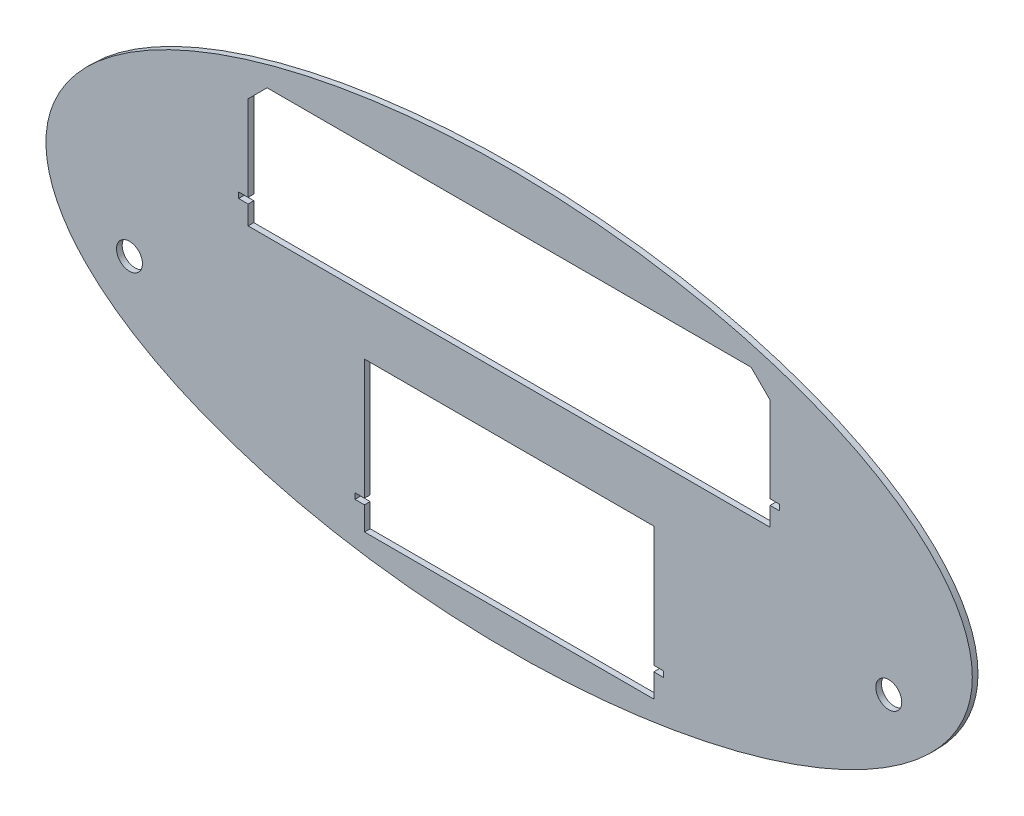
ISO-10303-21;
HEADER;
FILE_DESCRIPTION(('STEP AP214'),'2;1');
FILE_NAME('part.step','',(''),(''),'','','');
FILE_SCHEMA(('AUTOMOTIVE_DESIGN { 1 0 10303 214 1 1 1 1 }'));
ENDSEC;
DATA;
#1=APPLICATION_CONTEXT('core data for automotive mechanical design processes');
#2=APPLICATION_PROTOCOL_DEFINITION('international standard','automotive_design',2000,#1);
#3=PRODUCT_CONTEXT('',#1,'mechanical');
#4=PRODUCT('Part','Part','',(#3));
#5=PRODUCT_RELATED_PRODUCT_CATEGORY('part','',(#4));
#6=PRODUCT_DEFINITION_FORMATION('','',#4);
#7=PRODUCT_DEFINITION_CONTEXT('part definition',#1,'design');
#8=PRODUCT_DEFINITION('design','',#6,#7);
#9=PRODUCT_DEFINITION_SHAPE('','',#8);
#10=(LENGTH_UNIT() NAMED_UNIT(*) SI_UNIT(.MILLI.,.METRE.));
#11=(NAMED_UNIT(*) PLANE_ANGLE_UNIT() SI_UNIT($,.RADIAN.));
#12=(NAMED_UNIT(*) SI_UNIT($,.STERADIAN.) SOLID_ANGLE_UNIT());
#13=UNCERTAINTY_MEASURE_WITH_UNIT(LENGTH_MEASURE(1.E-05),#10,'distance_accuracy_value','');
#14=(GEOMETRIC_REPRESENTATION_CONTEXT(3) GLOBAL_UNCERTAINTY_ASSIGNED_CONTEXT((#13)) GLOBAL_UNIT_ASSIGNED_CONTEXT((#10,
#11,#12)) REPRESENTATION_CONTEXT('',''));
#15=CARTESIAN_POINT('',(0.,0.,0.));
#16=DIRECTION('',(0.,0.,1.));
#17=DIRECTION('',(1.,0.,0.));
#18=AXIS2_PLACEMENT_3D('',#15,#16,#17);
#19=CARTESIAN_POINT('',(0.,0.,-3.));
#20=DIRECTION('',(0.,0.,1.));
#21=DIRECTION('',(1.,0.,0.));
#22=AXIS2_PLACEMENT_3D('',#19,#20,#21);
#23=ELLIPSE('',#22,244.,110.);
#24=DIRECTION('',(0.,0.,1.));
#25=VECTOR('',#24,1.);
#26=SURFACE_OF_LINEAR_EXTRUSION('',#23,#25);
#27=CARTESIAN_POINT('',(244.,0.,-3.));
#28=VERTEX_POINT('',#27);
#29=EDGE_CURVE('E408',#28,#28,#23,.T.);
#30=ORIENTED_EDGE('',*,*,#29,.T.);
#31=EDGE_LOOP('',(#30));
#32=FACE_BOUND('',#31,.T.);
#33=CARTESIAN_POINT('',(0.,0.,0.));
#34=DIRECTION('',(0.,0.,1.));
#35=DIRECTION('',(1.,0.,0.));
#36=AXIS2_PLACEMENT_3D('',#33,#34,#35);
#37=ELLIPSE('',#36,244.,110.);
#38=CARTESIAN_POINT('',(244.,0.,0.));
#39=VERTEX_POINT('',#38);
#40=EDGE_CURVE('E389',#39,#39,#37,.T.);
#41=ORIENTED_EDGE('',*,*,#40,.F.);
#42=EDGE_LOOP('',(#41));
#43=FACE_BOUND('',#42,.T.);
#44=ADVANCED_FACE('F35',(#32,#43),#26,.T.);
#45=CARTESIAN_POINT('',(0.,0.,-3.));
#46=DIRECTION('',(0.,0.,1.));
#47=DIRECTION('',(1.,0.,0.));
#48=AXIS2_PLACEMENT_3D('',#45,#46,#47);
#49=PLANE('',#48);
#50=CARTESIAN_POINT('',(200.,-30.,-3.));
#51=DIRECTION('',(0.,0.,1.));
#52=DIRECTION('',(1.,0.,0.));
#53=AXIS2_PLACEMENT_3D('',#50,#51,#52);
#54=CIRCLE('',#53,6.83635541999999);
#55=CARTESIAN_POINT('',(206.83635542,-30.,-3.));
#56=VERTEX_POINT('',#55);
#57=EDGE_CURVE('E268',#56,#56,#54,.T.);
#58=ORIENTED_EDGE('',*,*,#57,.T.);
#59=EDGE_LOOP('',(#58));
#60=FACE_BOUND('',#59,.T.);
#61=CARTESIAN_POINT('',(-200.,-30.,-3.));
#62=DIRECTION('',(0.,0.,1.));
#63=DIRECTION('',(-1.,0.,0.));
#64=AXIS2_PLACEMENT_3D('',#61,#62,#63);
#65=CIRCLE('',#64,6.83635541999999);
#66=CARTESIAN_POINT('',(-206.83635542,-30.,-3.));
#67=VERTEX_POINT('',#66);
#68=EDGE_CURVE('E534',#67,#67,#65,.T.);
#69=ORIENTED_EDGE('',*,*,#68,.T.);
#70=EDGE_LOOP('',(#69));
#71=FACE_BOUND('',#70,.T.);
#72=DIRECTION('',(-1.,0.,0.));
#73=VECTOR('',#72,1.);
#74=CARTESIAN_POINT('',(-76.2,-15.,-3.));
#75=LINE('',#74,#73);
#76=CARTESIAN_POINT('',(76.2,-15.,-3.));
#77=VERTEX_POINT('',#76);
#78=CARTESIAN_POINT('',(-76.2,-15.,-3.));
#79=VERTEX_POINT('',#78);
#80=EDGE_CURVE('E219',#77,#79,#75,.T.);
#81=ORIENTED_EDGE('',*,*,#80,.T.);
#82=DIRECTION('',(0.,-1.,0.));
#83=VECTOR('',#82,1.);
#84=CARTESIAN_POINT('',(-76.2,-15.,-3.));
#85=LINE('',#84,#83);
#86=CARTESIAN_POINT('',(-76.2,-78.5,-3.));
#87=VERTEX_POINT('',#86);
#88=EDGE_CURVE('E211',#79,#87,#85,.T.);
#89=ORIENTED_EDGE('',*,*,#88,.T.);
#90=DIRECTION('',(-1.,0.,0.));
#91=VECTOR('',#90,1.);
#92=CARTESIAN_POINT('',(-81.2,-78.5,-3.));
#93=LINE('',#92,#91);
#94=CARTESIAN_POINT('',(-81.2,-78.5,-3.));
#95=VERTEX_POINT('',#94);
#96=EDGE_CURVE('E223',#87,#95,#93,.T.);
#97=ORIENTED_EDGE('',*,*,#96,.T.);
#98=DIRECTION('',(0.,-1.,0.));
#99=VECTOR('',#98,1.);
#100=CARTESIAN_POINT('',(-81.2,-78.5,-3.));
#101=LINE('',#100,#99);
#102=CARTESIAN_POINT('',(-81.2,-81.5,-3.));
#103=VERTEX_POINT('',#102);
#104=EDGE_CURVE('E227',#95,#103,#101,.T.);
#105=ORIENTED_EDGE('',*,*,#104,.T.);
#106=DIRECTION('',(1.,0.,0.));
#107=VECTOR('',#106,1.);
#108=CARTESIAN_POINT('',(-81.2,-81.5,-3.));
#109=LINE('',#108,#107);
#110=CARTESIAN_POINT('',(-76.2,-81.5,-3.));
#111=VERTEX_POINT('',#110);
#112=EDGE_CURVE('E242',#103,#111,#109,.T.);
#113=ORIENTED_EDGE('',*,*,#112,.T.);
#114=DIRECTION('',(0.,-1.,0.));
#115=VECTOR('',#114,1.);
#116=CARTESIAN_POINT('',(-76.2,-81.5,-3.));
#117=LINE('',#116,#115);
#118=CARTESIAN_POINT('',(-76.2,-93.9,-3.));
#119=VERTEX_POINT('',#118);
#120=EDGE_CURVE('E245',#111,#119,#117,.T.);
#121=ORIENTED_EDGE('',*,*,#120,.T.);
#122=DIRECTION('',(1.,0.,0.));
#123=VECTOR('',#122,1.);
#124=CARTESIAN_POINT('',(-76.2,-93.9,-3.));
#125=LINE('',#124,#123);
#126=CARTESIAN_POINT('',(76.2,-93.9,-3.));
#127=VERTEX_POINT('',#126);
#128=EDGE_CURVE('E248',#119,#127,#125,.T.);
#129=ORIENTED_EDGE('',*,*,#128,.T.);
#130=DIRECTION('',(0.,1.,0.));
#131=VECTOR('',#130,1.);
#132=CARTESIAN_POINT('',(76.2,-81.5,-3.));
#133=LINE('',#132,#131);
#134=CARTESIAN_POINT('',(76.2,-81.5,-3.));
#135=VERTEX_POINT('',#134);
#136=EDGE_CURVE('E251',#127,#135,#133,.T.);
#137=ORIENTED_EDGE('',*,*,#136,.T.);
#138=DIRECTION('',(1.,0.,0.));
#139=VECTOR('',#138,1.);
#140=CARTESIAN_POINT('',(76.2,-81.5,-3.));
#141=LINE('',#140,#139);
#142=CARTESIAN_POINT('',(81.2,-81.5,-3.));
#143=VERTEX_POINT('',#142);
#144=EDGE_CURVE('E254',#135,#143,#141,.T.);
#145=ORIENTED_EDGE('',*,*,#144,.T.);
#146=DIRECTION('',(0.,1.,0.));
#147=VECTOR('',#146,1.);
#148=CARTESIAN_POINT('',(81.2,-78.5,-3.));
#149=LINE('',#148,#147);
#150=CARTESIAN_POINT('',(81.2,-78.5,-3.));
#151=VERTEX_POINT('',#150);
#152=EDGE_CURVE('E257',#143,#151,#149,.T.);
#153=ORIENTED_EDGE('',*,*,#152,.T.);
#154=DIRECTION('',(-1.,0.,0.));
#155=VECTOR('',#154,1.);
#156=CARTESIAN_POINT('',(76.2,-78.5,-3.));
#157=LINE('',#156,#155);
#158=CARTESIAN_POINT('',(76.2,-78.5,-3.));
#159=VERTEX_POINT('',#158);
#160=EDGE_CURVE('E260',#151,#159,#157,.T.);
#161=ORIENTED_EDGE('',*,*,#160,.T.);
#162=DIRECTION('',(0.,1.,0.));
#163=VECTOR('',#162,1.);
#164=CARTESIAN_POINT('',(76.2,-15.,-3.));
#165=LINE('',#164,#163);
#166=EDGE_CURVE('E263',#159,#77,#165,.T.);
#167=ORIENTED_EDGE('',*,*,#166,.T.);
#168=EDGE_LOOP('',(#81,#89,#97,#105,#113,#121,#129,#137,#145,#153,#161,#167));
#169=FACE_BOUND('',#168,.T.);
#170=DIRECTION('',(0.,1.,0.));
#171=VECTOR('',#170,1.);
#172=CARTESIAN_POINT('',(137.5,83.1,-3.));
#173=LINE('',#172,#171);
#174=CARTESIAN_POINT('',(137.5,28.1000000000011,-3.));
#175=VERTEX_POINT('',#174);
#176=CARTESIAN_POINT('',(137.5,73.0999999999999,-3.));
#177=VERTEX_POINT('',#176);
#178=EDGE_CURVE('E348',#175,#177,#173,.T.);
#179=ORIENTED_EDGE('',*,*,#178,.T.);
#180=DIRECTION('',(0.707106781186548,-0.707106781186548,0.));
#181=VECTOR('',#180,1.);
#182=CARTESIAN_POINT('',(105.3,105.3,-3.));
#183=LINE('',#182,#181);
#184=CARTESIAN_POINT('',(127.5,83.1,-3.));
#185=VERTEX_POINT('',#184);
#186=EDGE_CURVE('E434',#177,#185,#183,.F.);
#187=ORIENTED_EDGE('',*,*,#186,.T.);
#188=DIRECTION('',(-1.,0.,0.));
#189=VECTOR('',#188,1.);
#190=CARTESIAN_POINT('',(-137.5,83.1,-3.));
#191=LINE('',#190,#189);
#192=CARTESIAN_POINT('',(-127.5,83.1,-3.));
#193=VERTEX_POINT('',#192);
#194=EDGE_CURVE('E351',#185,#193,#191,.T.);
#195=ORIENTED_EDGE('',*,*,#194,.T.);
#196=DIRECTION('',(0.707106781186544,0.707106781186551,0.));
#197=VECTOR('',#196,1.);
#198=CARTESIAN_POINT('',(-105.300000000001,105.3,-3.));
#199=LINE('',#198,#197);
#200=CARTESIAN_POINT('',(-137.5,73.1,-3.));
#201=VERTEX_POINT('',#200);
#202=EDGE_CURVE('E11',#193,#201,#199,.F.);
#203=ORIENTED_EDGE('',*,*,#202,.T.);
#204=DIRECTION('',(0.,-1.,0.));
#205=VECTOR('',#204,1.);
#206=CARTESIAN_POINT('',(-137.5,83.1,-3.));
#207=LINE('',#206,#205);
#208=CARTESIAN_POINT('',(-137.5,28.1000000000011,-3.));
#209=VERTEX_POINT('',#208);
#210=EDGE_CURVE('E318',#201,#209,#207,.T.);
#211=ORIENTED_EDGE('',*,*,#210,.T.);
#212=DIRECTION('',(-1.,0.,0.));
#213=VECTOR('',#212,1.);
#214=CARTESIAN_POINT('',(-137.5,28.1000000000011,-3.));
#215=LINE('',#214,#213);
#216=CARTESIAN_POINT('',(-142.5,28.1000000000011,-3.));
#217=VERTEX_POINT('',#216);
#218=EDGE_CURVE('E320',#209,#217,#215,.T.);
#219=ORIENTED_EDGE('',*,*,#218,.T.);
#220=DIRECTION('',(0.,-1.,0.));
#221=VECTOR('',#220,1.);
#222=CARTESIAN_POINT('',(-142.5,28.1000000000011,-3.));
#223=LINE('',#222,#221);
#224=CARTESIAN_POINT('',(-142.5,25.1,-3.));
#225=VERTEX_POINT('',#224);
#226=EDGE_CURVE('E324',#217,#225,#223,.T.);
#227=ORIENTED_EDGE('',*,*,#226,.T.);
#228=DIRECTION('',(1.,0.,0.));
#229=VECTOR('',#228,1.);
#230=CARTESIAN_POINT('',(-142.5,25.1,-3.));
#231=LINE('',#230,#229);
#232=CARTESIAN_POINT('',(-137.5,25.1,-3.));
#233=VERTEX_POINT('',#232);
#234=EDGE_CURVE('E327',#225,#233,#231,.T.);
#235=ORIENTED_EDGE('',*,*,#234,.T.);
#236=DIRECTION('',(0.,-1.,0.));
#237=VECTOR('',#236,1.);
#238=CARTESIAN_POINT('',(-137.5,25.1,-3.));
#239=LINE('',#238,#237);
#240=CARTESIAN_POINT('',(-137.5,15.1,-3.));
#241=VERTEX_POINT('',#240);
#242=EDGE_CURVE('E330',#233,#241,#239,.T.);
#243=ORIENTED_EDGE('',*,*,#242,.T.);
#244=DIRECTION('',(1.,0.,0.));
#245=VECTOR('',#244,1.);
#246=CARTESIAN_POINT('',(137.5,15.1,-3.));
#247=LINE('',#246,#245);
#248=CARTESIAN_POINT('',(137.5,15.1,-3.));
#249=VERTEX_POINT('',#248);
#250=EDGE_CURVE('E333',#241,#249,#247,.T.);
#251=ORIENTED_EDGE('',*,*,#250,.T.);
#252=DIRECTION('',(0.,1.,0.));
#253=VECTOR('',#252,1.);
#254=CARTESIAN_POINT('',(137.5,25.1,-3.));
#255=LINE('',#254,#253);
#256=CARTESIAN_POINT('',(137.5,25.1,-3.));
#257=VERTEX_POINT('',#256);
#258=EDGE_CURVE('E336',#249,#257,#255,.T.);
#259=ORIENTED_EDGE('',*,*,#258,.T.);
#260=DIRECTION('',(1.,0.,0.));
#261=VECTOR('',#260,1.);
#262=CARTESIAN_POINT('',(142.5,25.1,-3.));
#263=LINE('',#262,#261);
#264=CARTESIAN_POINT('',(142.5,25.1,-3.));
#265=VERTEX_POINT('',#264);
#266=EDGE_CURVE('E339',#257,#265,#263,.T.);
#267=ORIENTED_EDGE('',*,*,#266,.T.);
#268=DIRECTION('',(0.,1.,0.));
#269=VECTOR('',#268,1.);
#270=CARTESIAN_POINT('',(142.5,28.1000000000011,-3.));
#271=LINE('',#270,#269);
#272=CARTESIAN_POINT('',(142.5,28.1000000000011,-3.));
#273=VERTEX_POINT('',#272);
#274=EDGE_CURVE('E342',#265,#273,#271,.T.);
#275=ORIENTED_EDGE('',*,*,#274,.T.);
#276=DIRECTION('',(-1.,0.,0.));
#277=VECTOR('',#276,1.);
#278=CARTESIAN_POINT('',(137.5,28.1000000000011,-3.));
#279=LINE('',#278,#277);
#280=EDGE_CURVE('E345',#273,#175,#279,.T.);
#281=ORIENTED_EDGE('',*,*,#280,.T.);
#282=EDGE_LOOP('',(#179,#187,#195,#203,#211,#219,#227,#235,#243,#251,#259,#267,#275,#281));
#283=FACE_BOUND('',#282,.T.);
#284=ORIENTED_EDGE('',*,*,#29,.F.);
#285=EDGE_LOOP('',(#284));
#286=FACE_BOUND('',#285,.T.);
#287=ADVANCED_FACE('F229',(#60,#71,#169,#283,#286),#49,.F.);
#288=CARTESIAN_POINT('',(0.,0.,0.));
#289=DIRECTION('',(0.,0.,1.));
#290=DIRECTION('',(1.,0.,0.));
#291=AXIS2_PLACEMENT_3D('',#288,#289,#290);
#292=PLANE('',#291);
#293=CARTESIAN_POINT('',(200.,-30.,0.));
#294=DIRECTION('',(0.,0.,1.));
#295=DIRECTION('',(1.,0.,0.));
#296=AXIS2_PLACEMENT_3D('',#293,#294,#295);
#297=CIRCLE('',#296,6.83635541999999);
#298=CARTESIAN_POINT('',(206.83635542,-30.,0.));
#299=VERTEX_POINT('',#298);
#300=EDGE_CURVE('E536',#299,#299,#297,.T.);
#301=ORIENTED_EDGE('',*,*,#300,.F.);
#302=EDGE_LOOP('',(#301));
#303=FACE_BOUND('',#302,.T.);
#304=CARTESIAN_POINT('',(-200.,-30.,0.));
#305=DIRECTION('',(0.,0.,1.));
#306=DIRECTION('',(-1.,0.,0.));
#307=AXIS2_PLACEMENT_3D('',#304,#305,#306);
#308=CIRCLE('',#307,6.83635541999999);
#309=CARTESIAN_POINT('',(-206.83635542,-30.,0.));
#310=VERTEX_POINT('',#309);
#311=EDGE_CURVE('E238',#310,#310,#308,.T.);
#312=ORIENTED_EDGE('',*,*,#311,.F.);
#313=EDGE_LOOP('',(#312));
#314=FACE_BOUND('',#313,.T.);
#315=DIRECTION('',(0.,-1.,0.));
#316=VECTOR('',#315,1.);
#317=CARTESIAN_POINT('',(-76.2,-15.,0.));
#318=LINE('',#317,#316);
#319=CARTESIAN_POINT('',(-76.2,-15.,0.));
#320=VERTEX_POINT('',#319);
#321=CARTESIAN_POINT('',(-76.2,-78.5,0.));
#322=VERTEX_POINT('',#321);
#323=EDGE_CURVE('E214',#320,#322,#318,.T.);
#324=ORIENTED_EDGE('',*,*,#323,.F.);
#325=DIRECTION('',(-1.,0.,0.));
#326=VECTOR('',#325,1.);
#327=CARTESIAN_POINT('',(-76.2,-15.,0.));
#328=LINE('',#327,#326);
#329=CARTESIAN_POINT('',(76.2,-15.,0.));
#330=VERTEX_POINT('',#329);
#331=EDGE_CURVE('E232',#330,#320,#328,.T.);
#332=ORIENTED_EDGE('',*,*,#331,.F.);
#333=DIRECTION('',(0.,1.,0.));
#334=VECTOR('',#333,1.);
#335=CARTESIAN_POINT('',(76.2,-15.,0.));
#336=LINE('',#335,#334);
#337=CARTESIAN_POINT('',(76.2,-78.5,0.));
#338=VERTEX_POINT('',#337);
#339=EDGE_CURVE('E235',#338,#330,#336,.T.);
#340=ORIENTED_EDGE('',*,*,#339,.F.);
#341=DIRECTION('',(-1.,0.,0.));
#342=VECTOR('',#341,1.);
#343=CARTESIAN_POINT('',(76.2,-78.5,0.));
#344=LINE('',#343,#342);
#345=CARTESIAN_POINT('',(81.2,-78.5,0.));
#346=VERTEX_POINT('',#345);
#347=EDGE_CURVE('E291',#346,#338,#344,.T.);
#348=ORIENTED_EDGE('',*,*,#347,.F.);
#349=DIRECTION('',(0.,1.,0.));
#350=VECTOR('',#349,1.);
#351=CARTESIAN_POINT('',(81.2,-78.5,0.));
#352=LINE('',#351,#350);
#353=CARTESIAN_POINT('',(81.2,-81.5,0.));
#354=VERTEX_POINT('',#353);
#355=EDGE_CURVE('E288',#354,#346,#352,.T.);
#356=ORIENTED_EDGE('',*,*,#355,.F.);
#357=DIRECTION('',(1.,0.,0.));
#358=VECTOR('',#357,1.);
#359=CARTESIAN_POINT('',(76.2,-81.5,0.));
#360=LINE('',#359,#358);
#361=CARTESIAN_POINT('',(76.2,-81.5,0.));
#362=VERTEX_POINT('',#361);
#363=EDGE_CURVE('E285',#362,#354,#360,.T.);
#364=ORIENTED_EDGE('',*,*,#363,.F.);
#365=DIRECTION('',(0.,1.,0.));
#366=VECTOR('',#365,1.);
#367=CARTESIAN_POINT('',(76.2,-81.5,0.));
#368=LINE('',#367,#366);
#369=CARTESIAN_POINT('',(76.2,-93.9,0.));
#370=VERTEX_POINT('',#369);
#371=EDGE_CURVE('E282',#370,#362,#368,.T.);
#372=ORIENTED_EDGE('',*,*,#371,.F.);
#373=DIRECTION('',(1.,0.,0.));
#374=VECTOR('',#373,1.);
#375=CARTESIAN_POINT('',(-76.2,-93.9,0.));
#376=LINE('',#375,#374);
#377=CARTESIAN_POINT('',(-76.2,-93.9,0.));
#378=VERTEX_POINT('',#377);
#379=EDGE_CURVE('E279',#378,#370,#376,.T.);
#380=ORIENTED_EDGE('',*,*,#379,.F.);
#381=DIRECTION('',(0.,-1.,0.));
#382=VECTOR('',#381,1.);
#383=CARTESIAN_POINT('',(-76.2,-81.5,0.));
#384=LINE('',#383,#382);
#385=CARTESIAN_POINT('',(-76.2,-81.5,0.));
#386=VERTEX_POINT('',#385);
#387=EDGE_CURVE('E276',#386,#378,#384,.T.);
#388=ORIENTED_EDGE('',*,*,#387,.F.);
#389=DIRECTION('',(1.,0.,0.));
#390=VECTOR('',#389,1.);
#391=CARTESIAN_POINT('',(-81.2,-81.5,0.));
#392=LINE('',#391,#390);
#393=CARTESIAN_POINT('',(-81.2,-81.5,0.));
#394=VERTEX_POINT('',#393);
#395=EDGE_CURVE('E273',#394,#386,#392,.T.);
#396=ORIENTED_EDGE('',*,*,#395,.F.);
#397=DIRECTION('',(0.,-1.,0.));
#398=VECTOR('',#397,1.);
#399=CARTESIAN_POINT('',(-81.2,-78.5,0.));
#400=LINE('',#399,#398);
#401=CARTESIAN_POINT('',(-81.2,-78.5,0.));
#402=VERTEX_POINT('',#401);
#403=EDGE_CURVE('E270',#402,#394,#400,.T.);
#404=ORIENTED_EDGE('',*,*,#403,.F.);
#405=DIRECTION('',(-1.,0.,0.));
#406=VECTOR('',#405,1.);
#407=CARTESIAN_POINT('',(-81.2,-78.5,0.));
#408=LINE('',#407,#406);
#409=EDGE_CURVE('E267',#322,#402,#408,.T.);
#410=ORIENTED_EDGE('',*,*,#409,.F.);
#411=EDGE_LOOP('',(#324,#332,#340,#348,#356,#364,#372,#380,#388,#396,#404,#410));
#412=FACE_BOUND('',#411,.T.);
#413=DIRECTION('',(0.,-1.,0.));
#414=VECTOR('',#413,1.);
#415=CARTESIAN_POINT('',(-137.5,83.1,0.));
#416=LINE('',#415,#414);
#417=CARTESIAN_POINT('',(-137.5,73.1,0.));
#418=VERTEX_POINT('',#417);
#419=CARTESIAN_POINT('',(-137.5,28.1000000000011,0.));
#420=VERTEX_POINT('',#419);
#421=EDGE_CURVE('E298',#418,#420,#416,.T.);
#422=ORIENTED_EDGE('',*,*,#421,.F.);
#423=DIRECTION('',(-0.707106781186544,-0.707106781186551,0.));
#424=VECTOR('',#423,1.);
#425=CARTESIAN_POINT('',(-137.5,73.1,0.));
#426=LINE('',#425,#424);
#427=CARTESIAN_POINT('',(-127.5,83.1,0.));
#428=VERTEX_POINT('',#427);
#429=EDGE_CURVE('E43',#418,#428,#426,.F.);
#430=ORIENTED_EDGE('',*,*,#429,.T.);
#431=DIRECTION('',(-1.,0.,0.));
#432=VECTOR('',#431,1.);
#433=CARTESIAN_POINT('',(-137.5,83.1,0.));
#434=LINE('',#433,#432);
#435=CARTESIAN_POINT('',(127.5,83.1,0.));
#436=VERTEX_POINT('',#435);
#437=EDGE_CURVE('E321',#436,#428,#434,.T.);
#438=ORIENTED_EDGE('',*,*,#437,.F.);
#439=DIRECTION('',(-0.707106781186548,0.707106781186548,0.));
#440=VECTOR('',#439,1.);
#441=CARTESIAN_POINT('',(127.5,83.1,0.));
#442=LINE('',#441,#440);
#443=CARTESIAN_POINT('',(137.5,73.0999999999999,0.));
#444=VERTEX_POINT('',#443);
#445=EDGE_CURVE('E439',#436,#444,#442,.F.);
#446=ORIENTED_EDGE('',*,*,#445,.T.);
#447=DIRECTION('',(0.,1.,0.));
#448=VECTOR('',#447,1.);
#449=CARTESIAN_POINT('',(137.5,83.1,0.));
#450=LINE('',#449,#448);
#451=CARTESIAN_POINT('',(137.5,28.1000000000011,0.));
#452=VERTEX_POINT('',#451);
#453=EDGE_CURVE('E382',#452,#444,#450,.T.);
#454=ORIENTED_EDGE('',*,*,#453,.F.);
#455=DIRECTION('',(-1.,0.,0.));
#456=VECTOR('',#455,1.);
#457=CARTESIAN_POINT('',(137.5,28.1000000000011,0.));
#458=LINE('',#457,#456);
#459=CARTESIAN_POINT('',(142.5,28.1000000000011,0.));
#460=VERTEX_POINT('',#459);
#461=EDGE_CURVE('E379',#460,#452,#458,.T.);
#462=ORIENTED_EDGE('',*,*,#461,.F.);
#463=DIRECTION('',(0.,1.,0.));
#464=VECTOR('',#463,1.);
#465=CARTESIAN_POINT('',(142.5,28.1000000000011,0.));
#466=LINE('',#465,#464);
#467=CARTESIAN_POINT('',(142.5,25.1,0.));
#468=VERTEX_POINT('',#467);
#469=EDGE_CURVE('E376',#468,#460,#466,.T.);
#470=ORIENTED_EDGE('',*,*,#469,.F.);
#471=DIRECTION('',(1.,0.,0.));
#472=VECTOR('',#471,1.);
#473=CARTESIAN_POINT('',(142.5,25.1,0.));
#474=LINE('',#473,#472);
#475=CARTESIAN_POINT('',(137.5,25.1,0.));
#476=VERTEX_POINT('',#475);
#477=EDGE_CURVE('E373',#476,#468,#474,.T.);
#478=ORIENTED_EDGE('',*,*,#477,.F.);
#479=DIRECTION('',(0.,1.,0.));
#480=VECTOR('',#479,1.);
#481=CARTESIAN_POINT('',(137.5,25.1,0.));
#482=LINE('',#481,#480);
#483=CARTESIAN_POINT('',(137.5,15.1,0.));
#484=VERTEX_POINT('',#483);
#485=EDGE_CURVE('E370',#484,#476,#482,.T.);
#486=ORIENTED_EDGE('',*,*,#485,.F.);
#487=DIRECTION('',(1.,0.,0.));
#488=VECTOR('',#487,1.);
#489=CARTESIAN_POINT('',(137.5,15.1,0.));
#490=LINE('',#489,#488);
#491=CARTESIAN_POINT('',(-137.5,15.1,0.));
#492=VERTEX_POINT('',#491);
#493=EDGE_CURVE('E367',#492,#484,#490,.T.);
#494=ORIENTED_EDGE('',*,*,#493,.F.);
#495=DIRECTION('',(0.,-1.,0.));
#496=VECTOR('',#495,1.);
#497=CARTESIAN_POINT('',(-137.5,25.1,0.));
#498=LINE('',#497,#496);
#499=CARTESIAN_POINT('',(-137.5,25.1,0.));
#500=VERTEX_POINT('',#499);
#501=EDGE_CURVE('E364',#500,#492,#498,.T.);
#502=ORIENTED_EDGE('',*,*,#501,.F.);
#503=DIRECTION('',(1.,0.,0.));
#504=VECTOR('',#503,1.);
#505=CARTESIAN_POINT('',(-142.5,25.1,0.));
#506=LINE('',#505,#504);
#507=CARTESIAN_POINT('',(-142.5,25.1,0.));
#508=VERTEX_POINT('',#507);
#509=EDGE_CURVE('E361',#508,#500,#506,.T.);
#510=ORIENTED_EDGE('',*,*,#509,.F.);
#511=DIRECTION('',(0.,-1.,0.));
#512=VECTOR('',#511,1.);
#513=CARTESIAN_POINT('',(-142.5,28.1000000000011,0.));
#514=LINE('',#513,#512);
#515=CARTESIAN_POINT('',(-142.5,28.1000000000011,0.));
#516=VERTEX_POINT('',#515);
#517=EDGE_CURVE('E358',#516,#508,#514,.T.);
#518=ORIENTED_EDGE('',*,*,#517,.F.);
#519=DIRECTION('',(-1.,0.,0.));
#520=VECTOR('',#519,1.);
#521=CARTESIAN_POINT('',(-137.5,28.1000000000011,0.));
#522=LINE('',#521,#520);
#523=EDGE_CURVE('E355',#420,#516,#522,.T.);
#524=ORIENTED_EDGE('',*,*,#523,.F.);
#525=EDGE_LOOP('',(#422,#430,#438,#446,#454,#462,#470,#478,#486,#494,#502,#510,#518,#524));
#526=FACE_BOUND('',#525,.T.);
#527=ORIENTED_EDGE('',*,*,#40,.T.);
#528=EDGE_LOOP('',(#527));
#529=FACE_BOUND('',#528,.T.);
#530=ADVANCED_FACE('F418',(#303,#314,#412,#526,#529),#292,.T.);
#531=CARTESIAN_POINT('',(-137.5,83.1,-3.));
#532=DIRECTION('',(-1.,0.,0.));
#533=DIRECTION('',(0.,-1.,0.));
#534=AXIS2_PLACEMENT_3D('',#531,#532,#533);
#535=PLANE('',#534);
#536=ORIENTED_EDGE('',*,*,#210,.F.);
#537=DIRECTION('',(0.,0.,1.));
#538=VECTOR('',#537,1.);
#539=CARTESIAN_POINT('',(-137.5,73.1,0.));
#540=LINE('',#539,#538);
#541=EDGE_CURVE('E441',#201,#418,#540,.T.);
#542=ORIENTED_EDGE('',*,*,#541,.T.);
#543=ORIENTED_EDGE('',*,*,#421,.T.);
#544=DIRECTION('',(0.,0.,1.));
#545=VECTOR('',#544,1.);
#546=CARTESIAN_POINT('',(-137.5,28.1000000000011,-3.));
#547=LINE('',#546,#545);
#548=EDGE_CURVE('E353',#209,#420,#547,.T.);
#549=ORIENTED_EDGE('',*,*,#548,.F.);
#550=EDGE_LOOP('',(#536,#542,#543,#549));
#551=FACE_BOUND('',#550,.T.);
#552=ADVANCED_FACE('F452',(#551),#535,.F.);
#553=CARTESIAN_POINT('',(-137.5,83.1,-3.));
#554=DIRECTION('',(0.,1.,0.));
#555=DIRECTION('',(0.,0.,1.));
#556=AXIS2_PLACEMENT_3D('',#553,#554,#555);
#557=PLANE('',#556);
#558=ORIENTED_EDGE('',*,*,#194,.F.);
#559=DIRECTION('',(0.,0.,1.));
#560=VECTOR('',#559,1.);
#561=CARTESIAN_POINT('',(127.5,83.1,0.));
#562=LINE('',#561,#560);
#563=EDGE_CURVE('E437',#185,#436,#562,.T.);
#564=ORIENTED_EDGE('',*,*,#563,.T.);
#565=ORIENTED_EDGE('',*,*,#437,.T.);
#566=DIRECTION('',(0.,0.,-1.));
#567=VECTOR('',#566,1.);
#568=CARTESIAN_POINT('',(-127.5,83.1,-3.));
#569=LINE('',#568,#567);
#570=EDGE_CURVE('E412',#428,#193,#569,.T.);
#571=ORIENTED_EDGE('',*,*,#570,.T.);
#572=EDGE_LOOP('',(#558,#564,#565,#571));
#573=FACE_BOUND('',#572,.T.);
#574=ADVANCED_FACE('F447',(#573),#557,.F.);
#575=CARTESIAN_POINT('',(137.5,83.1,-3.));
#576=DIRECTION('',(1.,0.,0.));
#577=DIRECTION('',(0.,1.,0.));
#578=AXIS2_PLACEMENT_3D('',#575,#576,#577);
#579=PLANE('',#578);
#580=ORIENTED_EDGE('',*,*,#453,.T.);
#581=DIRECTION('',(0.,0.,-1.));
#582=VECTOR('',#581,1.);
#583=CARTESIAN_POINT('',(137.5,73.0999999999999,-3.));
#584=LINE('',#583,#582);
#585=EDGE_CURVE('E435',#444,#177,#584,.T.);
#586=ORIENTED_EDGE('',*,*,#585,.T.);
#587=ORIENTED_EDGE('',*,*,#178,.F.);
#588=DIRECTION('',(0.,0.,1.));
#589=VECTOR('',#588,1.);
#590=CARTESIAN_POINT('',(137.5,28.1000000000011,-3.));
#591=LINE('',#590,#589);
#592=EDGE_CURVE('E387',#175,#452,#591,.T.);
#593=ORIENTED_EDGE('',*,*,#592,.T.);
#594=EDGE_LOOP('',(#580,#586,#587,#593));
#595=FACE_BOUND('',#594,.T.);
#596=ADVANCED_FACE('F495',(#595),#579,.F.);
#597=CARTESIAN_POINT('',(137.5,28.1000000000011,-3.));
#598=DIRECTION('',(0.,1.,0.));
#599=DIRECTION('',(0.,0.,1.));
#600=AXIS2_PLACEMENT_3D('',#597,#598,#599);
#601=PLANE('',#600);
#602=ORIENTED_EDGE('',*,*,#461,.T.);
#603=ORIENTED_EDGE('',*,*,#592,.F.);
#604=ORIENTED_EDGE('',*,*,#280,.F.);
#605=DIRECTION('',(0.,0.,1.));
#606=VECTOR('',#605,1.);
#607=CARTESIAN_POINT('',(142.5,28.1000000000011,-3.));
#608=LINE('',#607,#606);
#609=EDGE_CURVE('E390',#273,#460,#608,.T.);
#610=ORIENTED_EDGE('',*,*,#609,.T.);
#611=EDGE_LOOP('',(#602,#603,#604,#610));
#612=FACE_BOUND('',#611,.T.);
#613=ADVANCED_FACE('F491',(#612),#601,.F.);
#614=CARTESIAN_POINT('',(142.5,28.1000000000011,-3.));
#615=DIRECTION('',(1.,0.,0.));
#616=DIRECTION('',(0.,0.,-1.));
#617=AXIS2_PLACEMENT_3D('',#614,#615,#616);
#618=PLANE('',#617);
#619=ORIENTED_EDGE('',*,*,#469,.T.);
#620=ORIENTED_EDGE('',*,*,#609,.F.);
#621=ORIENTED_EDGE('',*,*,#274,.F.);
#622=DIRECTION('',(0.,0.,1.));
#623=VECTOR('',#622,1.);
#624=CARTESIAN_POINT('',(142.5,25.1,-3.));
#625=LINE('',#624,#623);
#626=EDGE_CURVE('E392',#265,#468,#625,.T.);
#627=ORIENTED_EDGE('',*,*,#626,.T.);
#628=EDGE_LOOP('',(#619,#620,#621,#627));
#629=FACE_BOUND('',#628,.T.);
#630=ADVANCED_FACE('F487',(#629),#618,.F.);
#631=CARTESIAN_POINT('',(142.5,25.1,-3.));
#632=DIRECTION('',(0.,-1.,0.));
#633=DIRECTION('',(0.,0.,-1.));
#634=AXIS2_PLACEMENT_3D('',#631,#632,#633);
#635=PLANE('',#634);
#636=ORIENTED_EDGE('',*,*,#477,.T.);
#637=ORIENTED_EDGE('',*,*,#626,.F.);
#638=ORIENTED_EDGE('',*,*,#266,.F.);
#639=DIRECTION('',(0.,0.,1.));
#640=VECTOR('',#639,1.);
#641=CARTESIAN_POINT('',(137.5,25.1,-3.));
#642=LINE('',#641,#640);
#643=EDGE_CURVE('E394',#257,#476,#642,.T.);
#644=ORIENTED_EDGE('',*,*,#643,.T.);
#645=EDGE_LOOP('',(#636,#637,#638,#644));
#646=FACE_BOUND('',#645,.T.);
#647=ADVANCED_FACE('F483',(#646),#635,.F.);
#648=CARTESIAN_POINT('',(137.5,25.1,-3.));
#649=DIRECTION('',(1.,0.,0.));
#650=DIRECTION('',(0.,0.,-1.));
#651=AXIS2_PLACEMENT_3D('',#648,#649,#650);
#652=PLANE('',#651);
#653=ORIENTED_EDGE('',*,*,#485,.T.);
#654=ORIENTED_EDGE('',*,*,#643,.F.);
#655=ORIENTED_EDGE('',*,*,#258,.F.);
#656=DIRECTION('',(0.,0.,1.));
#657=VECTOR('',#656,1.);
#658=CARTESIAN_POINT('',(137.5,15.1,-3.));
#659=LINE('',#658,#657);
#660=EDGE_CURVE('E396',#249,#484,#659,.T.);
#661=ORIENTED_EDGE('',*,*,#660,.T.);
#662=EDGE_LOOP('',(#653,#654,#655,#661));
#663=FACE_BOUND('',#662,.T.);
#664=ADVANCED_FACE('F479',(#663),#652,.F.);
#665=CARTESIAN_POINT('',(137.5,15.1,-3.));
#666=DIRECTION('',(0.,-1.,0.));
#667=DIRECTION('',(0.,0.,-1.));
#668=AXIS2_PLACEMENT_3D('',#665,#666,#667);
#669=PLANE('',#668);
#670=ORIENTED_EDGE('',*,*,#493,.T.);
#671=ORIENTED_EDGE('',*,*,#660,.F.);
#672=ORIENTED_EDGE('',*,*,#250,.F.);
#673=DIRECTION('',(0.,0.,1.));
#674=VECTOR('',#673,1.);
#675=CARTESIAN_POINT('',(-137.5,15.1,-3.));
#676=LINE('',#675,#674);
#677=EDGE_CURVE('E398',#241,#492,#676,.T.);
#678=ORIENTED_EDGE('',*,*,#677,.T.);
#679=EDGE_LOOP('',(#670,#671,#672,#678));
#680=FACE_BOUND('',#679,.T.);
#681=ADVANCED_FACE('F475',(#680),#669,.F.);
#682=CARTESIAN_POINT('',(-137.5,25.1,-3.));
#683=DIRECTION('',(-1.,0.,0.));
#684=DIRECTION('',(0.,0.,1.));
#685=AXIS2_PLACEMENT_3D('',#682,#683,#684);
#686=PLANE('',#685);
#687=ORIENTED_EDGE('',*,*,#501,.T.);
#688=ORIENTED_EDGE('',*,*,#677,.F.);
#689=ORIENTED_EDGE('',*,*,#242,.F.);
#690=DIRECTION('',(0.,0.,1.));
#691=VECTOR('',#690,1.);
#692=CARTESIAN_POINT('',(-137.5,25.1,-3.));
#693=LINE('',#692,#691);
#694=EDGE_CURVE('E400',#233,#500,#693,.T.);
#695=ORIENTED_EDGE('',*,*,#694,.T.);
#696=EDGE_LOOP('',(#687,#688,#689,#695));
#697=FACE_BOUND('',#696,.T.);
#698=ADVANCED_FACE('F471',(#697),#686,.F.);
#699=CARTESIAN_POINT('',(-142.5,25.1,-3.));
#700=DIRECTION('',(0.,-1.,0.));
#701=DIRECTION('',(0.,0.,-1.));
#702=AXIS2_PLACEMENT_3D('',#699,#700,#701);
#703=PLANE('',#702);
#704=ORIENTED_EDGE('',*,*,#509,.T.);
#705=ORIENTED_EDGE('',*,*,#694,.F.);
#706=ORIENTED_EDGE('',*,*,#234,.F.);
#707=DIRECTION('',(0.,0.,1.));
#708=VECTOR('',#707,1.);
#709=CARTESIAN_POINT('',(-142.5,25.1,-3.));
#710=LINE('',#709,#708);
#711=EDGE_CURVE('E402',#225,#508,#710,.T.);
#712=ORIENTED_EDGE('',*,*,#711,.T.);
#713=EDGE_LOOP('',(#704,#705,#706,#712));
#714=FACE_BOUND('',#713,.T.);
#715=ADVANCED_FACE('F467',(#714),#703,.F.);
#716=CARTESIAN_POINT('',(-142.5,28.1000000000011,-3.));
#717=DIRECTION('',(-1.,0.,0.));
#718=DIRECTION('',(0.,0.,1.));
#719=AXIS2_PLACEMENT_3D('',#716,#717,#718);
#720=PLANE('',#719);
#721=ORIENTED_EDGE('',*,*,#517,.T.);
#722=ORIENTED_EDGE('',*,*,#711,.F.);
#723=ORIENTED_EDGE('',*,*,#226,.F.);
#724=DIRECTION('',(0.,0.,1.));
#725=VECTOR('',#724,1.);
#726=CARTESIAN_POINT('',(-142.5,28.1000000000011,-3.));
#727=LINE('',#726,#725);
#728=EDGE_CURVE('E404',#217,#516,#727,.T.);
#729=ORIENTED_EDGE('',*,*,#728,.T.);
#730=EDGE_LOOP('',(#721,#722,#723,#729));
#731=FACE_BOUND('',#730,.T.);
#732=ADVANCED_FACE('F465',(#731),#720,.F.);
#733=CARTESIAN_POINT('',(-137.5,28.1000000000011,-3.));
#734=DIRECTION('',(0.,1.,0.));
#735=DIRECTION('',(0.,0.,1.));
#736=AXIS2_PLACEMENT_3D('',#733,#734,#735);
#737=PLANE('',#736);
#738=ORIENTED_EDGE('',*,*,#523,.T.);
#739=ORIENTED_EDGE('',*,*,#728,.F.);
#740=ORIENTED_EDGE('',*,*,#218,.F.);
#741=ORIENTED_EDGE('',*,*,#548,.T.);
#742=EDGE_LOOP('',(#738,#739,#740,#741));
#743=FACE_BOUND('',#742,.T.);
#744=ADVANCED_FACE('F461',(#743),#737,.F.);
#745=CARTESIAN_POINT('',(-76.2,-15.,-3.));
#746=DIRECTION('',(-1.,0.,0.));
#747=DIRECTION('',(0.,-1.,0.));
#748=AXIS2_PLACEMENT_3D('',#745,#746,#747);
#749=PLANE('',#748);
#750=ORIENTED_EDGE('',*,*,#323,.T.);
#751=DIRECTION('',(0.,0.,1.));
#752=VECTOR('',#751,1.);
#753=CARTESIAN_POINT('',(-76.2,-78.5,-3.));
#754=LINE('',#753,#752);
#755=EDGE_CURVE('E207',#87,#322,#754,.T.);
#756=ORIENTED_EDGE('',*,*,#755,.F.);
#757=ORIENTED_EDGE('',*,*,#88,.F.);
#758=DIRECTION('',(0.,0.,1.));
#759=VECTOR('',#758,1.);
#760=CARTESIAN_POINT('',(-76.2,-15.,-3.));
#761=LINE('',#760,#759);
#762=EDGE_CURVE('E296',#79,#320,#761,.T.);
#763=ORIENTED_EDGE('',*,*,#762,.T.);
#764=EDGE_LOOP('',(#750,#756,#757,#763));
#765=FACE_BOUND('',#764,.T.);
#766=ADVANCED_FACE('F209',(#765),#749,.F.);
#767=CARTESIAN_POINT('',(-76.2,-15.,-3.));
#768=DIRECTION('',(0.,1.,0.));
#769=DIRECTION('',(0.,0.,1.));
#770=AXIS2_PLACEMENT_3D('',#767,#768,#769);
#771=PLANE('',#770);
#772=ORIENTED_EDGE('',*,*,#331,.T.);
#773=ORIENTED_EDGE('',*,*,#762,.F.);
#774=ORIENTED_EDGE('',*,*,#80,.F.);
#775=DIRECTION('',(0.,0.,1.));
#776=VECTOR('',#775,1.);
#777=CARTESIAN_POINT('',(76.2,-15.,-3.));
#778=LINE('',#777,#776);
#779=EDGE_CURVE('E299',#77,#330,#778,.T.);
#780=ORIENTED_EDGE('',*,*,#779,.T.);
#781=EDGE_LOOP('',(#772,#773,#774,#780));
#782=FACE_BOUND('',#781,.T.);
#783=ADVANCED_FACE('F582',(#782),#771,.F.);
#784=CARTESIAN_POINT('',(76.2,-15.,-3.));
#785=DIRECTION('',(1.,0.,0.));
#786=DIRECTION('',(0.,0.,-1.));
#787=AXIS2_PLACEMENT_3D('',#784,#785,#786);
#788=PLANE('',#787);
#789=ORIENTED_EDGE('',*,*,#339,.T.);
#790=ORIENTED_EDGE('',*,*,#779,.F.);
#791=ORIENTED_EDGE('',*,*,#166,.F.);
#792=DIRECTION('',(0.,0.,1.));
#793=VECTOR('',#792,1.);
#794=CARTESIAN_POINT('',(76.2,-78.5,-3.));
#795=LINE('',#794,#793);
#796=EDGE_CURVE('E301',#159,#338,#795,.T.);
#797=ORIENTED_EDGE('',*,*,#796,.T.);
#798=EDGE_LOOP('',(#789,#790,#791,#797));
#799=FACE_BOUND('',#798,.T.);
#800=ADVANCED_FACE('F580',(#799),#788,.F.);
#801=CARTESIAN_POINT('',(76.2,-78.5,-3.));
#802=DIRECTION('',(0.,1.,0.));
#803=DIRECTION('',(0.,0.,1.));
#804=AXIS2_PLACEMENT_3D('',#801,#802,#803);
#805=PLANE('',#804);
#806=ORIENTED_EDGE('',*,*,#347,.T.);
#807=ORIENTED_EDGE('',*,*,#796,.F.);
#808=ORIENTED_EDGE('',*,*,#160,.F.);
#809=DIRECTION('',(0.,0.,1.));
#810=VECTOR('',#809,1.);
#811=CARTESIAN_POINT('',(81.2,-78.5,-3.));
#812=LINE('',#811,#810);
#813=EDGE_CURVE('E303',#151,#346,#812,.T.);
#814=ORIENTED_EDGE('',*,*,#813,.T.);
#815=EDGE_LOOP('',(#806,#807,#808,#814));
#816=FACE_BOUND('',#815,.T.);
#817=ADVANCED_FACE('F577',(#816),#805,.F.);
#818=CARTESIAN_POINT('',(81.2,-78.5,-3.));
#819=DIRECTION('',(1.,0.,0.));
#820=DIRECTION('',(0.,0.,-1.));
#821=AXIS2_PLACEMENT_3D('',#818,#819,#820);
#822=PLANE('',#821);
#823=ORIENTED_EDGE('',*,*,#355,.T.);
#824=ORIENTED_EDGE('',*,*,#813,.F.);
#825=ORIENTED_EDGE('',*,*,#152,.F.);
#826=DIRECTION('',(0.,0.,1.));
#827=VECTOR('',#826,1.);
#828=CARTESIAN_POINT('',(81.2,-81.5,-3.));
#829=LINE('',#828,#827);
#830=EDGE_CURVE('E305',#143,#354,#829,.T.);
#831=ORIENTED_EDGE('',*,*,#830,.T.);
#832=EDGE_LOOP('',(#823,#824,#825,#831));
#833=FACE_BOUND('',#832,.T.);
#834=ADVANCED_FACE('F573',(#833),#822,.F.);
#835=CARTESIAN_POINT('',(76.2,-81.5,-3.));
#836=DIRECTION('',(0.,-1.,0.));
#837=DIRECTION('',(0.,0.,-1.));
#838=AXIS2_PLACEMENT_3D('',#835,#836,#837);
#839=PLANE('',#838);
#840=ORIENTED_EDGE('',*,*,#363,.T.);
#841=ORIENTED_EDGE('',*,*,#830,.F.);
#842=ORIENTED_EDGE('',*,*,#144,.F.);
#843=DIRECTION('',(0.,0.,1.));
#844=VECTOR('',#843,1.);
#845=CARTESIAN_POINT('',(76.2,-81.5,-3.));
#846=LINE('',#845,#844);
#847=EDGE_CURVE('E307',#135,#362,#846,.T.);
#848=ORIENTED_EDGE('',*,*,#847,.T.);
#849=EDGE_LOOP('',(#840,#841,#842,#848));
#850=FACE_BOUND('',#849,.T.);
#851=ADVANCED_FACE('F569',(#850),#839,.F.);
#852=CARTESIAN_POINT('',(76.2,-81.5,-3.));
#853=DIRECTION('',(1.,0.,0.));
#854=DIRECTION('',(0.,1.,0.));
#855=AXIS2_PLACEMENT_3D('',#852,#853,#854);
#856=PLANE('',#855);
#857=ORIENTED_EDGE('',*,*,#371,.T.);
#858=ORIENTED_EDGE('',*,*,#847,.F.);
#859=ORIENTED_EDGE('',*,*,#136,.F.);
#860=DIRECTION('',(0.,0.,1.));
#861=VECTOR('',#860,1.);
#862=CARTESIAN_POINT('',(76.2,-93.9,-3.));
#863=LINE('',#862,#861);
#864=EDGE_CURVE('E309',#127,#370,#863,.T.);
#865=ORIENTED_EDGE('',*,*,#864,.T.);
#866=EDGE_LOOP('',(#857,#858,#859,#865));
#867=FACE_BOUND('',#866,.T.);
#868=ADVANCED_FACE('F565',(#867),#856,.F.);
#869=CARTESIAN_POINT('',(-76.2,-93.9,-3.));
#870=DIRECTION('',(0.,-1.,0.));
#871=DIRECTION('',(0.,0.,-1.));
#872=AXIS2_PLACEMENT_3D('',#869,#870,#871);
#873=PLANE('',#872);
#874=ORIENTED_EDGE('',*,*,#379,.T.);
#875=ORIENTED_EDGE('',*,*,#864,.F.);
#876=ORIENTED_EDGE('',*,*,#128,.F.);
#877=DIRECTION('',(0.,0.,1.));
#878=VECTOR('',#877,1.);
#879=CARTESIAN_POINT('',(-76.2,-93.9,-3.));
#880=LINE('',#879,#878);
#881=EDGE_CURVE('E311',#119,#378,#880,.T.);
#882=ORIENTED_EDGE('',*,*,#881,.T.);
#883=EDGE_LOOP('',(#874,#875,#876,#882));
#884=FACE_BOUND('',#883,.T.);
#885=ADVANCED_FACE('F561',(#884),#873,.F.);
#886=CARTESIAN_POINT('',(-76.2,-81.5,-3.));
#887=DIRECTION('',(-1.,0.,0.));
#888=DIRECTION('',(0.,-1.,0.));
#889=AXIS2_PLACEMENT_3D('',#886,#887,#888);
#890=PLANE('',#889);
#891=ORIENTED_EDGE('',*,*,#387,.T.);
#892=ORIENTED_EDGE('',*,*,#881,.F.);
#893=ORIENTED_EDGE('',*,*,#120,.F.);
#894=DIRECTION('',(0.,0.,1.));
#895=VECTOR('',#894,1.);
#896=CARTESIAN_POINT('',(-76.2,-81.5,-3.));
#897=LINE('',#896,#895);
#898=EDGE_CURVE('E313',#111,#386,#897,.T.);
#899=ORIENTED_EDGE('',*,*,#898,.T.);
#900=EDGE_LOOP('',(#891,#892,#893,#899));
#901=FACE_BOUND('',#900,.T.);
#902=ADVANCED_FACE('F557',(#901),#890,.F.);
#903=CARTESIAN_POINT('',(-81.2,-81.5,-3.));
#904=DIRECTION('',(0.,-1.,0.));
#905=DIRECTION('',(0.,0.,-1.));
#906=AXIS2_PLACEMENT_3D('',#903,#904,#905);
#907=PLANE('',#906);
#908=ORIENTED_EDGE('',*,*,#395,.T.);
#909=ORIENTED_EDGE('',*,*,#898,.F.);
#910=ORIENTED_EDGE('',*,*,#112,.F.);
#911=DIRECTION('',(0.,0.,1.));
#912=VECTOR('',#911,1.);
#913=CARTESIAN_POINT('',(-81.2,-81.5,-3.));
#914=LINE('',#913,#912);
#915=EDGE_CURVE('E315',#103,#394,#914,.T.);
#916=ORIENTED_EDGE('',*,*,#915,.T.);
#917=EDGE_LOOP('',(#908,#909,#910,#916));
#918=FACE_BOUND('',#917,.T.);
#919=ADVANCED_FACE('F555',(#918),#907,.F.);
#920=CARTESIAN_POINT('',(-81.2,-78.5,-3.));
#921=DIRECTION('',(-1.,0.,0.));
#922=DIRECTION('',(0.,0.,1.));
#923=AXIS2_PLACEMENT_3D('',#920,#921,#922);
#924=PLANE('',#923);
#925=ORIENTED_EDGE('',*,*,#403,.T.);
#926=ORIENTED_EDGE('',*,*,#915,.F.);
#927=ORIENTED_EDGE('',*,*,#104,.F.);
#928=DIRECTION('',(0.,0.,1.));
#929=VECTOR('',#928,1.);
#930=CARTESIAN_POINT('',(-81.2,-78.5,-3.));
#931=LINE('',#930,#929);
#932=EDGE_CURVE('E218',#95,#402,#931,.T.);
#933=ORIENTED_EDGE('',*,*,#932,.T.);
#934=EDGE_LOOP('',(#925,#926,#927,#933));
#935=FACE_BOUND('',#934,.T.);
#936=ADVANCED_FACE('F551',(#935),#924,.F.);
#937=CARTESIAN_POINT('',(-81.2,-78.5,-3.));
#938=DIRECTION('',(0.,1.,0.));
#939=DIRECTION('',(0.,0.,1.));
#940=AXIS2_PLACEMENT_3D('',#937,#938,#939);
#941=PLANE('',#940);
#942=ORIENTED_EDGE('',*,*,#409,.T.);
#943=ORIENTED_EDGE('',*,*,#932,.F.);
#944=ORIENTED_EDGE('',*,*,#96,.F.);
#945=ORIENTED_EDGE('',*,*,#755,.T.);
#946=EDGE_LOOP('',(#942,#943,#944,#945));
#947=FACE_BOUND('',#946,.T.);
#948=ADVANCED_FACE('F224',(#947),#941,.F.);
#949=CARTESIAN_POINT('',(-200.,-30.,-3.));
#950=DIRECTION('',(0.,0.,1.));
#951=DIRECTION('',(1.,0.,0.));
#952=AXIS2_PLACEMENT_3D('',#949,#950,#951);
#953=CYLINDRICAL_SURFACE('',#952,6.83635541999999);
#954=ORIENTED_EDGE('',*,*,#68,.F.);
#955=EDGE_LOOP('',(#954));
#956=FACE_BOUND('',#955,.T.);
#957=ORIENTED_EDGE('',*,*,#311,.T.);
#958=EDGE_LOOP('',(#957));
#959=FACE_BOUND('',#958,.T.);
#960=ADVANCED_FACE('F428',(#956,#959),#953,.F.);
#961=CARTESIAN_POINT('',(200.,-30.,-3.));
#962=DIRECTION('',(0.,0.,1.));
#963=DIRECTION('',(1.,0.,0.));
#964=AXIS2_PLACEMENT_3D('',#961,#962,#963);
#965=CYLINDRICAL_SURFACE('',#964,6.83635541999999);
#966=ORIENTED_EDGE('',*,*,#57,.F.);
#967=EDGE_LOOP('',(#966));
#968=FACE_BOUND('',#967,.T.);
#969=ORIENTED_EDGE('',*,*,#300,.T.);
#970=EDGE_LOOP('',(#969));
#971=FACE_BOUND('',#970,.T.);
#972=ADVANCED_FACE('F422',(#968,#971),#965,.F.);
#973=CARTESIAN_POINT('',(127.5,83.1,-3.));
#974=DIRECTION('',(-0.707106781186547,-0.707106781186547,0.));
#975=DIRECTION('',(0.,0.,-1.));
#976=AXIS2_PLACEMENT_3D('',#973,#974,#975);
#977=PLANE('',#976);
#978=ORIENTED_EDGE('',*,*,#186,.F.);
#979=ORIENTED_EDGE('',*,*,#585,.F.);
#980=ORIENTED_EDGE('',*,*,#445,.F.);
#981=ORIENTED_EDGE('',*,*,#563,.F.);
#982=EDGE_LOOP('',(#978,#979,#980,#981));
#983=FACE_BOUND('',#982,.T.);
#984=ADVANCED_FACE('F420',(#983),#977,.T.);
#985=CARTESIAN_POINT('',(-137.5,73.1,-3.));
#986=DIRECTION('',(0.707106781186551,-0.707106781186544,0.));
#987=DIRECTION('',(0.,0.,-1.));
#988=AXIS2_PLACEMENT_3D('',#985,#986,#987);
#989=PLANE('',#988);
#990=ORIENTED_EDGE('',*,*,#202,.F.);
#991=ORIENTED_EDGE('',*,*,#570,.F.);
#992=ORIENTED_EDGE('',*,*,#429,.F.);
#993=ORIENTED_EDGE('',*,*,#541,.F.);
#994=EDGE_LOOP('',(#990,#991,#992,#993));
#995=FACE_BOUND('',#994,.T.);
#996=ADVANCED_FACE('F37',(#995),#989,.T.);
#997=CLOSED_SHELL('',(#44,#287,#530,#552,#574,#596,#613,#630,#647,#664,#681,#698,#715,#732,#744,
#766,#783,#800,#817,#834,#851,#868,#885,#902,#919,#936,#948,#960,#972,#984,#996));
#998=MANIFOLD_SOLID_BREP('B2',#997);
#999=ADVANCED_BREP_SHAPE_REPRESENTATION('',(#18,#998),#14);
#1000=SHAPE_DEFINITION_REPRESENTATION(#9,#999);
ENDSEC;
END-ISO-10303-21;
